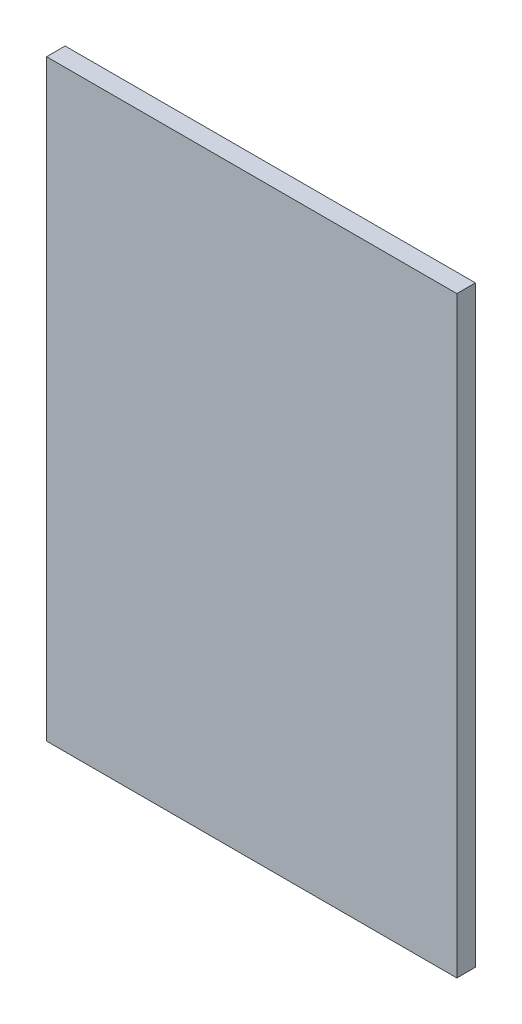
ISO-10303-21;
HEADER;
FILE_DESCRIPTION(('STEP AP214'),'2;1');
FILE_NAME('part.step','',(''),(''),'','','');
FILE_SCHEMA(('AUTOMOTIVE_DESIGN { 1 0 10303 214 1 1 1 1 }'));
ENDSEC;
DATA;
#1=APPLICATION_CONTEXT('core data for automotive mechanical design processes');
#2=APPLICATION_PROTOCOL_DEFINITION('international standard','automotive_design',2000,#1);
#3=PRODUCT_CONTEXT('',#1,'mechanical');
#4=PRODUCT('Part','Part','',(#3));
#5=PRODUCT_RELATED_PRODUCT_CATEGORY('part','',(#4));
#6=PRODUCT_DEFINITION_FORMATION('','',#4);
#7=PRODUCT_DEFINITION_CONTEXT('part definition',#1,'design');
#8=PRODUCT_DEFINITION('design','',#6,#7);
#9=PRODUCT_DEFINITION_SHAPE('','',#8);
#10=(LENGTH_UNIT() NAMED_UNIT(*) SI_UNIT(.MILLI.,.METRE.));
#11=(NAMED_UNIT(*) PLANE_ANGLE_UNIT() SI_UNIT($,.RADIAN.));
#12=(NAMED_UNIT(*) SI_UNIT($,.STERADIAN.) SOLID_ANGLE_UNIT());
#13=UNCERTAINTY_MEASURE_WITH_UNIT(LENGTH_MEASURE(1.E-05),#10,'distance_accuracy_value','');
#14=(GEOMETRIC_REPRESENTATION_CONTEXT(3) GLOBAL_UNCERTAINTY_ASSIGNED_CONTEXT((#13)) GLOBAL_UNIT_ASSIGNED_CONTEXT((#10,
#11,#12)) REPRESENTATION_CONTEXT('',''));
#15=CARTESIAN_POINT('',(0.,0.,0.));
#16=DIRECTION('',(0.,0.,1.));
#17=DIRECTION('',(1.,0.,0.));
#18=AXIS2_PLACEMENT_3D('',#15,#16,#17);
#19=CARTESIAN_POINT('',(-199.,-287.5,18.));
#20=DIRECTION('',(1.,0.,0.));
#21=DIRECTION('',(0.,0.,-1.));
#22=AXIS2_PLACEMENT_3D('',#19,#20,#21);
#23=PLANE('',#22);
#24=DIRECTION('',(0.,-1.,0.));
#25=VECTOR('',#24,1.);
#26=CARTESIAN_POINT('',(-199.,-287.5,0.));
#27=LINE('',#26,#25);
#28=CARTESIAN_POINT('',(-199.,287.5,0.));
#29=VERTEX_POINT('',#28);
#30=CARTESIAN_POINT('',(-199.,-287.5,0.));
#31=VERTEX_POINT('',#30);
#32=EDGE_CURVE('E96',#29,#31,#27,.T.);
#33=ORIENTED_EDGE('',*,*,#32,.T.);
#34=DIRECTION('',(0.,0.,-1.));
#35=VECTOR('',#34,1.);
#36=CARTESIAN_POINT('',(-199.,-287.5,18.));
#37=LINE('',#36,#35);
#38=CARTESIAN_POINT('',(-199.,-287.5,18.));
#39=VERTEX_POINT('',#38);
#40=EDGE_CURVE('E11',#39,#31,#37,.T.);
#41=ORIENTED_EDGE('',*,*,#40,.F.);
#42=DIRECTION('',(0.,-1.,0.));
#43=VECTOR('',#42,1.);
#44=CARTESIAN_POINT('',(-199.,-287.5,18.));
#45=LINE('',#44,#43);
#46=CARTESIAN_POINT('',(-199.,287.5,18.));
#47=VERTEX_POINT('',#46);
#48=EDGE_CURVE('E84',#47,#39,#45,.T.);
#49=ORIENTED_EDGE('',*,*,#48,.F.);
#50=DIRECTION('',(0.,0.,-1.));
#51=VECTOR('',#50,1.);
#52=CARTESIAN_POINT('',(-199.,287.5,18.));
#53=LINE('',#52,#51);
#54=EDGE_CURVE('E92',#47,#29,#53,.T.);
#55=ORIENTED_EDGE('',*,*,#54,.T.);
#56=EDGE_LOOP('',(#33,#41,#49,#55));
#57=FACE_BOUND('',#56,.T.);
#58=ADVANCED_FACE('F33',(#57),#23,.F.);
#59=CARTESIAN_POINT('',(199.,-287.5,18.));
#60=DIRECTION('',(0.,1.,0.));
#61=DIRECTION('',(0.,0.,1.));
#62=AXIS2_PLACEMENT_3D('',#59,#60,#61);
#63=PLANE('',#62);
#64=DIRECTION('',(1.,0.,0.));
#65=VECTOR('',#64,1.);
#66=CARTESIAN_POINT('',(199.,-287.5,0.));
#67=LINE('',#66,#65);
#68=CARTESIAN_POINT('',(199.,-287.5,0.));
#69=VERTEX_POINT('',#68);
#70=EDGE_CURVE('E88',#31,#69,#67,.T.);
#71=ORIENTED_EDGE('',*,*,#70,.T.);
#72=DIRECTION('',(0.,0.,-1.));
#73=VECTOR('',#72,1.);
#74=CARTESIAN_POINT('',(199.,-287.5,18.));
#75=LINE('',#74,#73);
#76=CARTESIAN_POINT('',(199.,-287.5,18.));
#77=VERTEX_POINT('',#76);
#78=EDGE_CURVE('E41',#77,#69,#75,.T.);
#79=ORIENTED_EDGE('',*,*,#78,.F.);
#80=DIRECTION('',(1.,0.,0.));
#81=VECTOR('',#80,1.);
#82=CARTESIAN_POINT('',(199.,-287.5,18.));
#83=LINE('',#82,#81);
#84=EDGE_CURVE('E79',#39,#77,#83,.T.);
#85=ORIENTED_EDGE('',*,*,#84,.F.);
#86=ORIENTED_EDGE('',*,*,#40,.T.);
#87=EDGE_LOOP('',(#71,#79,#85,#86));
#88=FACE_BOUND('',#87,.T.);
#89=ADVANCED_FACE('F87',(#88),#63,.F.);
#90=CARTESIAN_POINT('',(199.,-287.5,18.));
#91=DIRECTION('',(-1.,0.,0.));
#92=DIRECTION('',(0.,0.,1.));
#93=AXIS2_PLACEMENT_3D('',#90,#91,#92);
#94=PLANE('',#93);
#95=DIRECTION('',(0.,1.,0.));
#96=VECTOR('',#95,1.);
#97=CARTESIAN_POINT('',(199.,-287.5,0.));
#98=LINE('',#97,#96);
#99=CARTESIAN_POINT('',(199.,287.5,0.));
#100=VERTEX_POINT('',#99);
#101=EDGE_CURVE('E66',#69,#100,#98,.T.);
#102=ORIENTED_EDGE('',*,*,#101,.T.);
#103=DIRECTION('',(0.,0.,-1.));
#104=VECTOR('',#103,1.);
#105=CARTESIAN_POINT('',(199.,287.5,18.));
#106=LINE('',#105,#104);
#107=CARTESIAN_POINT('',(199.,287.5,18.));
#108=VERTEX_POINT('',#107);
#109=EDGE_CURVE('E89',#108,#100,#106,.T.);
#110=ORIENTED_EDGE('',*,*,#109,.F.);
#111=DIRECTION('',(0.,1.,0.));
#112=VECTOR('',#111,1.);
#113=CARTESIAN_POINT('',(199.,-287.5,18.));
#114=LINE('',#113,#112);
#115=EDGE_CURVE('E82',#77,#108,#114,.T.);
#116=ORIENTED_EDGE('',*,*,#115,.F.);
#117=ORIENTED_EDGE('',*,*,#78,.T.);
#118=EDGE_LOOP('',(#102,#110,#116,#117));
#119=FACE_BOUND('',#118,.T.);
#120=ADVANCED_FACE('F90',(#119),#94,.F.);
#121=CARTESIAN_POINT('',(199.,287.5,18.));
#122=DIRECTION('',(0.,-1.,0.));
#123=DIRECTION('',(0.,0.,-1.));
#124=AXIS2_PLACEMENT_3D('',#121,#122,#123);
#125=PLANE('',#124);
#126=DIRECTION('',(-1.,0.,0.));
#127=VECTOR('',#126,1.);
#128=CARTESIAN_POINT('',(199.,287.5,0.));
#129=LINE('',#128,#127);
#130=EDGE_CURVE('E72',#100,#29,#129,.T.);
#131=ORIENTED_EDGE('',*,*,#130,.T.);
#132=ORIENTED_EDGE('',*,*,#54,.F.);
#133=DIRECTION('',(-1.,0.,0.));
#134=VECTOR('',#133,1.);
#135=CARTESIAN_POINT('',(199.,287.5,18.));
#136=LINE('',#135,#134);
#137=EDGE_CURVE('E49',#108,#47,#136,.T.);
#138=ORIENTED_EDGE('',*,*,#137,.F.);
#139=ORIENTED_EDGE('',*,*,#109,.T.);
#140=EDGE_LOOP('',(#131,#132,#138,#139));
#141=FACE_BOUND('',#140,.T.);
#142=ADVANCED_FACE('F103',(#141),#125,.F.);
#143=CARTESIAN_POINT('',(0.,0.,18.));
#144=DIRECTION('',(0.,0.,1.));
#145=DIRECTION('',(1.,0.,0.));
#146=AXIS2_PLACEMENT_3D('',#143,#144,#145);
#147=PLANE('',#146);
#148=ORIENTED_EDGE('',*,*,#48,.T.);
#149=ORIENTED_EDGE('',*,*,#84,.T.);
#150=ORIENTED_EDGE('',*,*,#115,.T.);
#151=ORIENTED_EDGE('',*,*,#137,.T.);
#152=EDGE_LOOP('',(#148,#149,#150,#151));
#153=FACE_BOUND('',#152,.T.);
#154=ADVANCED_FACE('F80',(#153),#147,.T.);
#155=CARTESIAN_POINT('',(0.,0.,0.));
#156=DIRECTION('',(0.,0.,1.));
#157=DIRECTION('',(1.,0.,0.));
#158=AXIS2_PLACEMENT_3D('',#155,#156,#157);
#159=PLANE('',#158);
#160=ORIENTED_EDGE('',*,*,#32,.F.);
#161=ORIENTED_EDGE('',*,*,#130,.F.);
#162=ORIENTED_EDGE('',*,*,#101,.F.);
#163=ORIENTED_EDGE('',*,*,#70,.F.);
#164=EDGE_LOOP('',(#160,#161,#162,#163));
#165=FACE_BOUND('',#164,.T.);
#166=ADVANCED_FACE('F106',(#165),#159,.F.);
#167=CLOSED_SHELL('',(#58,#89,#120,#142,#154,#166));
#168=MANIFOLD_SOLID_BREP('B2',#167);
#169=ADVANCED_BREP_SHAPE_REPRESENTATION('',(#18,#168),#14);
#170=SHAPE_DEFINITION_REPRESENTATION(#9,#169);
ENDSEC;
END-ISO-10303-21;
